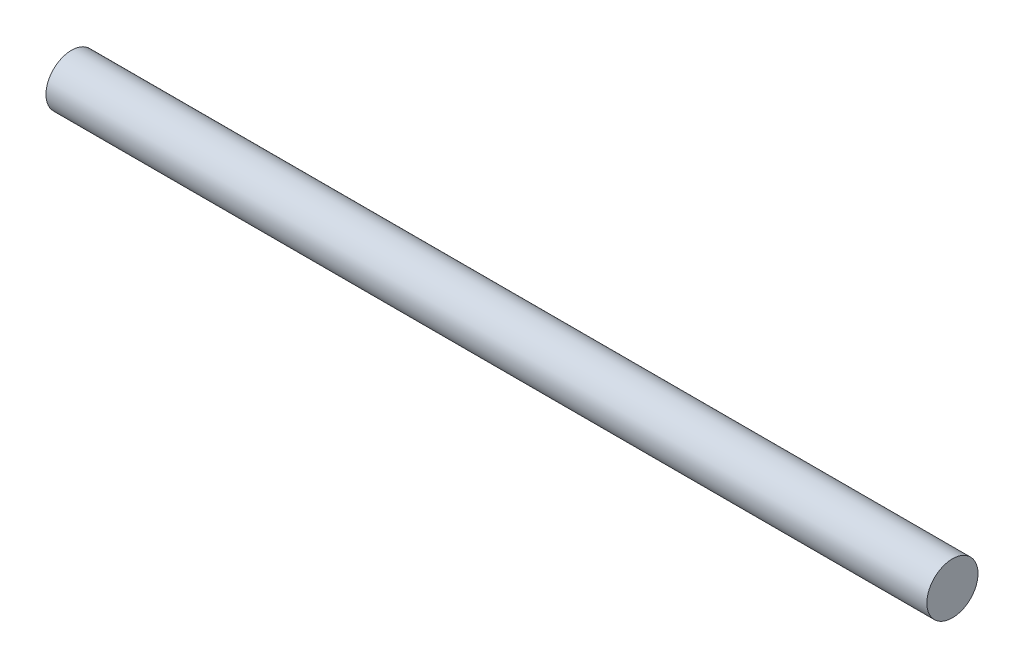
ISO-10303-21;
HEADER;
FILE_DESCRIPTION(('STEP AP214'),'2;1');
FILE_NAME('part.step','',(''),(''),'','','');
FILE_SCHEMA(('AUTOMOTIVE_DESIGN { 1 0 10303 214 1 1 1 1 }'));
ENDSEC;
DATA;
#1=APPLICATION_CONTEXT('core data for automotive mechanical design processes');
#2=APPLICATION_PROTOCOL_DEFINITION('international standard','automotive_design',2000,#1);
#3=PRODUCT_CONTEXT('',#1,'mechanical');
#4=PRODUCT('Part','Part','',(#3));
#5=PRODUCT_RELATED_PRODUCT_CATEGORY('part','',(#4));
#6=PRODUCT_DEFINITION_FORMATION('','',#4);
#7=PRODUCT_DEFINITION_CONTEXT('part definition',#1,'design');
#8=PRODUCT_DEFINITION('design','',#6,#7);
#9=PRODUCT_DEFINITION_SHAPE('','',#8);
#10=(LENGTH_UNIT() NAMED_UNIT(*) SI_UNIT(.MILLI.,.METRE.));
#11=(NAMED_UNIT(*) PLANE_ANGLE_UNIT() SI_UNIT($,.RADIAN.));
#12=(NAMED_UNIT(*) SI_UNIT($,.STERADIAN.) SOLID_ANGLE_UNIT());
#13=UNCERTAINTY_MEASURE_WITH_UNIT(LENGTH_MEASURE(1.E-05),#10,'distance_accuracy_value','');
#14=(GEOMETRIC_REPRESENTATION_CONTEXT(3) GLOBAL_UNCERTAINTY_ASSIGNED_CONTEXT((#13)) GLOBAL_UNIT_ASSIGNED_CONTEXT((#10,
#11,#12)) REPRESENTATION_CONTEXT('',''));
#15=CARTESIAN_POINT('',(0.,0.,0.));
#16=DIRECTION('',(0.,0.,1.));
#17=DIRECTION('',(1.,0.,0.));
#18=AXIS2_PLACEMENT_3D('',#15,#16,#17);
#19=CARTESIAN_POINT('',(620.,0.,0.));
#20=DIRECTION('',(-1.,0.,0.));
#21=DIRECTION('',(0.,0.,1.));
#22=AXIS2_PLACEMENT_3D('',#19,#20,#21);
#23=CYLINDRICAL_SURFACE('',#22,18.);
#24=CARTESIAN_POINT('',(620.,0.,0.));
#25=DIRECTION('',(1.,0.,0.));
#26=DIRECTION('',(0.,0.,-1.));
#27=AXIS2_PLACEMENT_3D('',#24,#25,#26);
#28=CIRCLE('',#27,18.);
#29=CARTESIAN_POINT('',(620.,0.,-18.));
#30=VERTEX_POINT('',#29);
#31=EDGE_CURVE('E10',#30,#30,#28,.T.);
#32=ORIENTED_EDGE('',*,*,#31,.F.);
#33=EDGE_LOOP('',(#32));
#34=FACE_BOUND('',#33,.T.);
#35=CARTESIAN_POINT('',(0.,0.,0.));
#36=DIRECTION('',(1.,0.,0.));
#37=DIRECTION('',(0.,0.,-1.));
#38=AXIS2_PLACEMENT_3D('',#35,#36,#37);
#39=CIRCLE('',#38,18.);
#40=CARTESIAN_POINT('',(0.,0.,-18.));
#41=VERTEX_POINT('',#40);
#42=EDGE_CURVE('E40',#41,#41,#39,.T.);
#43=ORIENTED_EDGE('',*,*,#42,.T.);
#44=EDGE_LOOP('',(#43));
#45=FACE_BOUND('',#44,.T.);
#46=ADVANCED_FACE('F37',(#34,#45),#23,.T.);
#47=CARTESIAN_POINT('',(620.,0.,0.));
#48=DIRECTION('',(1.,0.,0.));
#49=DIRECTION('',(0.,0.,-1.));
#50=AXIS2_PLACEMENT_3D('',#47,#48,#49);
#51=PLANE('',#50);
#52=ORIENTED_EDGE('',*,*,#31,.T.);
#53=EDGE_LOOP('',(#52));
#54=FACE_BOUND('',#53,.T.);
#55=ADVANCED_FACE('F52',(#54),#51,.T.);
#56=CARTESIAN_POINT('',(0.,0.,0.));
#57=DIRECTION('',(1.,0.,0.));
#58=DIRECTION('',(0.,0.,-1.));
#59=AXIS2_PLACEMENT_3D('',#56,#57,#58);
#60=PLANE('',#59);
#61=ORIENTED_EDGE('',*,*,#42,.F.);
#62=EDGE_LOOP('',(#61));
#63=FACE_BOUND('',#62,.T.);
#64=ADVANCED_FACE('F50',(#63),#60,.F.);
#65=CLOSED_SHELL('',(#46,#55,#64));
#66=MANIFOLD_SOLID_BREP('B2',#65);
#67=ADVANCED_BREP_SHAPE_REPRESENTATION('',(#18,#66),#14);
#68=SHAPE_DEFINITION_REPRESENTATION(#9,#67);
ENDSEC;
END-ISO-10303-21;
